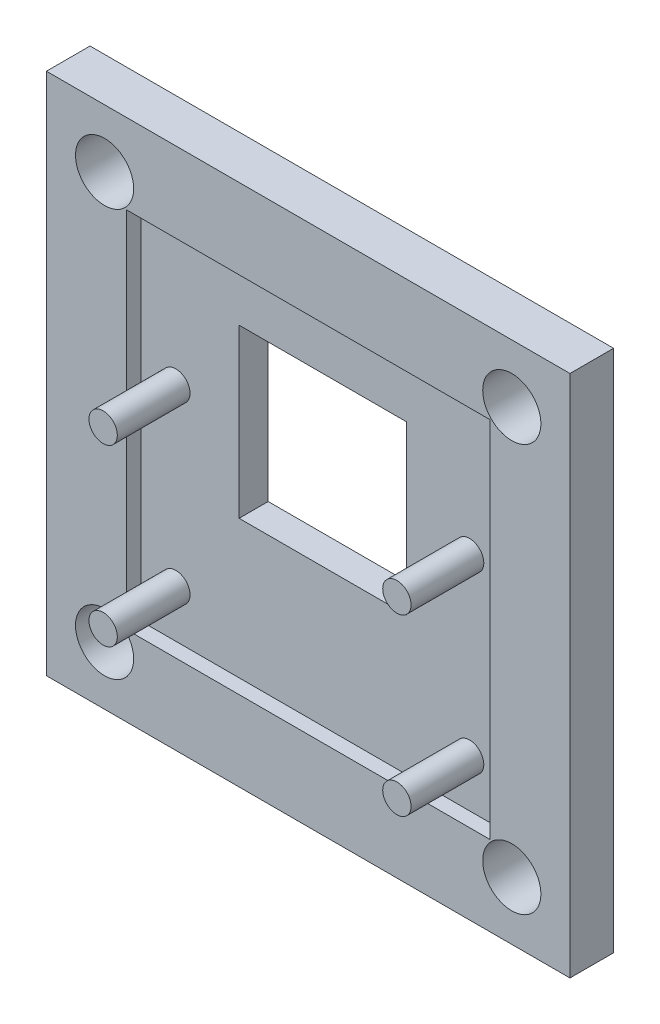
ISO-10303-21;
HEADER;
FILE_DESCRIPTION(('STEP AP214'),'2;1');
FILE_NAME('part.step','',(''),(''),'','','');
FILE_SCHEMA(('AUTOMOTIVE_DESIGN { 1 0 10303 214 1 1 1 1 }'));
ENDSEC;
DATA;
#1=APPLICATION_CONTEXT('core data for automotive mechanical design processes');
#2=APPLICATION_PROTOCOL_DEFINITION('international standard','automotive_design',2000,#1);
#3=PRODUCT_CONTEXT('',#1,'mechanical');
#4=PRODUCT('Part','Part','',(#3));
#5=PRODUCT_RELATED_PRODUCT_CATEGORY('part','',(#4));
#6=PRODUCT_DEFINITION_FORMATION('','',#4);
#7=PRODUCT_DEFINITION_CONTEXT('part definition',#1,'design');
#8=PRODUCT_DEFINITION('design','',#6,#7);
#9=PRODUCT_DEFINITION_SHAPE('','',#8);
#10=(LENGTH_UNIT() NAMED_UNIT(*) SI_UNIT(.MILLI.,.METRE.));
#11=(NAMED_UNIT(*) PLANE_ANGLE_UNIT() SI_UNIT($,.RADIAN.));
#12=(NAMED_UNIT(*) SI_UNIT($,.STERADIAN.) SOLID_ANGLE_UNIT());
#13=UNCERTAINTY_MEASURE_WITH_UNIT(LENGTH_MEASURE(1.E-05),#10,'distance_accuracy_value','');
#14=(GEOMETRIC_REPRESENTATION_CONTEXT(3) GLOBAL_UNCERTAINTY_ASSIGNED_CONTEXT((#13)) GLOBAL_UNIT_ASSIGNED_CONTEXT((#10,
#11,#12)) REPRESENTATION_CONTEXT('',''));
#15=CARTESIAN_POINT('',(0.,0.,0.));
#16=DIRECTION('',(0.,0.,1.));
#17=DIRECTION('',(1.,0.,0.));
#18=AXIS2_PLACEMENT_3D('',#15,#16,#17);
#19=CARTESIAN_POINT('',(0.,0.,2.));
#20=DIRECTION('',(0.,0.,-1.));
#21=DIRECTION('',(-1.,0.,0.));
#22=AXIS2_PLACEMENT_3D('',#19,#20,#21);
#23=PLANE('',#22);
#24=CARTESIAN_POINT('',(-10.1,2.75,2.));
#25=DIRECTION('',(0.,0.,-1.));
#26=DIRECTION('',(-1.,0.,0.));
#27=AXIS2_PLACEMENT_3D('',#24,#25,#26);
#28=CIRCLE('',#27,0.975);
#29=CARTESIAN_POINT('',(-11.075,2.75,2.));
#30=VERTEX_POINT('',#29);
#31=EDGE_CURVE('E11',#30,#30,#28,.F.);
#32=ORIENTED_EDGE('',*,*,#31,.F.);
#33=EDGE_LOOP('',(#32));
#34=FACE_BOUND('',#33,.T.);
#35=CARTESIAN_POINT('',(-10.1,-9.25,2.));
#36=DIRECTION('',(0.,0.,-1.));
#37=DIRECTION('',(-1.,0.,0.));
#38=AXIS2_PLACEMENT_3D('',#35,#36,#37);
#39=CIRCLE('',#38,0.975);
#40=CARTESIAN_POINT('',(-11.075,-9.25,2.));
#41=VERTEX_POINT('',#40);
#42=EDGE_CURVE('E54',#41,#41,#39,.F.);
#43=ORIENTED_EDGE('',*,*,#42,.F.);
#44=EDGE_LOOP('',(#43));
#45=FACE_BOUND('',#44,.T.);
#46=CARTESIAN_POINT('',(10.1,-9.25,2.));
#47=DIRECTION('',(0.,0.,-1.));
#48=DIRECTION('',(-1.,0.,0.));
#49=AXIS2_PLACEMENT_3D('',#46,#47,#48);
#50=CIRCLE('',#49,0.975);
#51=CARTESIAN_POINT('',(9.125,-9.25,2.));
#52=VERTEX_POINT('',#51);
#53=EDGE_CURVE('E309',#52,#52,#50,.F.);
#54=ORIENTED_EDGE('',*,*,#53,.F.);
#55=EDGE_LOOP('',(#54));
#56=FACE_BOUND('',#55,.T.);
#57=CARTESIAN_POINT('',(10.1,2.75,2.));
#58=DIRECTION('',(0.,0.,-1.));
#59=DIRECTION('',(-1.,0.,0.));
#60=AXIS2_PLACEMENT_3D('',#57,#58,#59);
#61=CIRCLE('',#60,0.975);
#62=CARTESIAN_POINT('',(9.125,2.75,2.));
#63=VERTEX_POINT('',#62);
#64=EDGE_CURVE('E291',#63,#63,#61,.F.);
#65=ORIENTED_EDGE('',*,*,#64,.F.);
#66=EDGE_LOOP('',(#65));
#67=FACE_BOUND('',#66,.T.);
#68=DIRECTION('',(0.,1.,0.));
#69=VECTOR('',#68,1.);
#70=CARTESIAN_POINT('',(12.5,-12.5,2.));
#71=LINE('',#70,#69);
#72=CARTESIAN_POINT('',(12.5,-12.5,2.));
#73=VERTEX_POINT('',#72);
#74=CARTESIAN_POINT('',(12.5,12.5,2.));
#75=VERTEX_POINT('',#74);
#76=EDGE_CURVE('E188',#73,#75,#71,.T.);
#77=ORIENTED_EDGE('',*,*,#76,.T.);
#78=DIRECTION('',(-1.,0.,0.));
#79=VECTOR('',#78,1.);
#80=CARTESIAN_POINT('',(-12.5,12.5,2.));
#81=LINE('',#80,#79);
#82=CARTESIAN_POINT('',(-12.5,12.5,2.));
#83=VERTEX_POINT('',#82);
#84=EDGE_CURVE('E192',#75,#83,#81,.T.);
#85=ORIENTED_EDGE('',*,*,#84,.T.);
#86=DIRECTION('',(0.,-1.,0.));
#87=VECTOR('',#86,1.);
#88=CARTESIAN_POINT('',(-12.5,-12.5,2.));
#89=LINE('',#88,#87);
#90=CARTESIAN_POINT('',(-12.5,-12.5,2.));
#91=VERTEX_POINT('',#90);
#92=EDGE_CURVE('E197',#83,#91,#89,.T.);
#93=ORIENTED_EDGE('',*,*,#92,.T.);
#94=DIRECTION('',(1.,0.,0.));
#95=VECTOR('',#94,1.);
#96=CARTESIAN_POINT('',(-12.5,-12.5,2.));
#97=LINE('',#96,#95);
#98=EDGE_CURVE('E201',#91,#73,#97,.T.);
#99=ORIENTED_EDGE('',*,*,#98,.T.);
#100=EDGE_LOOP('',(#77,#85,#93,#99));
#101=FACE_BOUND('',#100,.T.);
#102=DIRECTION('',(0.,1.,0.));
#103=VECTOR('',#102,1.);
#104=CARTESIAN_POINT('',(5.75,-3.,2.));
#105=LINE('',#104,#103);
#106=CARTESIAN_POINT('',(5.75,-3.,2.));
#107=VERTEX_POINT('',#106);
#108=CARTESIAN_POINT('',(5.75,8.5,2.));
#109=VERTEX_POINT('',#108);
#110=EDGE_CURVE('E141',#107,#109,#105,.T.);
#111=ORIENTED_EDGE('',*,*,#110,.F.);
#112=DIRECTION('',(1.,0.,0.));
#113=VECTOR('',#112,1.);
#114=CARTESIAN_POINT('',(-5.75,-3.,2.));
#115=LINE('',#114,#113);
#116=CARTESIAN_POINT('',(-5.75,-3.,2.));
#117=VERTEX_POINT('',#116);
#118=EDGE_CURVE('E159',#117,#107,#115,.T.);
#119=ORIENTED_EDGE('',*,*,#118,.F.);
#120=DIRECTION('',(0.,-1.,0.));
#121=VECTOR('',#120,1.);
#122=CARTESIAN_POINT('',(-5.75,-3.,2.));
#123=LINE('',#122,#121);
#124=CARTESIAN_POINT('',(-5.75,8.5,2.));
#125=VERTEX_POINT('',#124);
#126=EDGE_CURVE('E61',#125,#117,#123,.T.);
#127=ORIENTED_EDGE('',*,*,#126,.F.);
#128=DIRECTION('',(-1.,0.,0.));
#129=VECTOR('',#128,1.);
#130=CARTESIAN_POINT('',(-5.75,8.5,2.));
#131=LINE('',#130,#129);
#132=EDGE_CURVE('E174',#109,#125,#131,.T.);
#133=ORIENTED_EDGE('',*,*,#132,.F.);
#134=EDGE_LOOP('',(#111,#119,#127,#133));
#135=FACE_BOUND('',#134,.T.);
#136=ADVANCED_FACE('F45',(#34,#45,#56,#67,#101,#135),#23,.F.);
#137=CARTESIAN_POINT('',(18.,-18.,3.));
#138=DIRECTION('',(-1.,0.,0.));
#139=DIRECTION('',(0.,0.,1.));
#140=AXIS2_PLACEMENT_3D('',#137,#138,#139);
#141=PLANE('',#140);
#142=DIRECTION('',(0.,1.,0.));
#143=VECTOR('',#142,1.);
#144=CARTESIAN_POINT('',(18.,-18.,0.));
#145=LINE('',#144,#143);
#146=CARTESIAN_POINT('',(18.,-18.,0.));
#147=VERTEX_POINT('',#146);
#148=CARTESIAN_POINT('',(18.,18.,0.));
#149=VERTEX_POINT('',#148);
#150=EDGE_CURVE('E263',#147,#149,#145,.T.);
#151=ORIENTED_EDGE('',*,*,#150,.T.);
#152=DIRECTION('',(0.,0.,-1.));
#153=VECTOR('',#152,1.);
#154=CARTESIAN_POINT('',(18.,18.,3.));
#155=LINE('',#154,#153);
#156=CARTESIAN_POINT('',(18.,18.,3.));
#157=VERTEX_POINT('',#156);
#158=EDGE_CURVE('E287',#157,#149,#155,.T.);
#159=ORIENTED_EDGE('',*,*,#158,.F.);
#160=DIRECTION('',(0.,1.,0.));
#161=VECTOR('',#160,1.);
#162=CARTESIAN_POINT('',(18.,-18.,3.));
#163=LINE('',#162,#161);
#164=CARTESIAN_POINT('',(18.,-18.,3.));
#165=VERTEX_POINT('',#164);
#166=EDGE_CURVE('E248',#165,#157,#163,.T.);
#167=ORIENTED_EDGE('',*,*,#166,.F.);
#168=DIRECTION('',(0.,0.,-1.));
#169=VECTOR('',#168,1.);
#170=CARTESIAN_POINT('',(18.,-18.,3.));
#171=LINE('',#170,#169);
#172=EDGE_CURVE('E262',#165,#147,#171,.T.);
#173=ORIENTED_EDGE('',*,*,#172,.T.);
#174=EDGE_LOOP('',(#151,#159,#167,#173));
#175=FACE_BOUND('',#174,.T.);
#176=ADVANCED_FACE('F47',(#175),#141,.F.);
#177=CARTESIAN_POINT('',(-18.,18.,3.));
#178=DIRECTION('',(0.,-1.,0.));
#179=DIRECTION('',(0.,0.,-1.));
#180=AXIS2_PLACEMENT_3D('',#177,#178,#179);
#181=PLANE('',#180);
#182=DIRECTION('',(-1.,0.,0.));
#183=VECTOR('',#182,1.);
#184=CARTESIAN_POINT('',(-18.,18.,0.));
#185=LINE('',#184,#183);
#186=CARTESIAN_POINT('',(-18.,18.,0.));
#187=VERTEX_POINT('',#186);
#188=EDGE_CURVE('E267',#149,#187,#185,.T.);
#189=ORIENTED_EDGE('',*,*,#188,.T.);
#190=DIRECTION('',(0.,0.,-1.));
#191=VECTOR('',#190,1.);
#192=CARTESIAN_POINT('',(-18.,18.,3.));
#193=LINE('',#192,#191);
#194=CARTESIAN_POINT('',(-18.,18.,3.));
#195=VERTEX_POINT('',#194);
#196=EDGE_CURVE('E283',#195,#187,#193,.T.);
#197=ORIENTED_EDGE('',*,*,#196,.F.);
#198=DIRECTION('',(-1.,0.,0.));
#199=VECTOR('',#198,1.);
#200=CARTESIAN_POINT('',(-18.,18.,3.));
#201=LINE('',#200,#199);
#202=EDGE_CURVE('E252',#157,#195,#201,.T.);
#203=ORIENTED_EDGE('',*,*,#202,.F.);
#204=ORIENTED_EDGE('',*,*,#158,.T.);
#205=EDGE_LOOP('',(#189,#197,#203,#204));
#206=FACE_BOUND('',#205,.T.);
#207=ADVANCED_FACE('F389',(#206),#181,.F.);
#208=CARTESIAN_POINT('',(-18.,-18.,3.));
#209=DIRECTION('',(1.,0.,0.));
#210=DIRECTION('',(0.,0.,-1.));
#211=AXIS2_PLACEMENT_3D('',#208,#209,#210);
#212=PLANE('',#211);
#213=DIRECTION('',(0.,-1.,0.));
#214=VECTOR('',#213,1.);
#215=CARTESIAN_POINT('',(-18.,-18.,0.));
#216=LINE('',#215,#214);
#217=CARTESIAN_POINT('',(-18.,-18.,0.));
#218=VERTEX_POINT('',#217);
#219=EDGE_CURVE('E271',#187,#218,#216,.T.);
#220=ORIENTED_EDGE('',*,*,#219,.T.);
#221=DIRECTION('',(0.,0.,-1.));
#222=VECTOR('',#221,1.);
#223=CARTESIAN_POINT('',(-18.,-18.,3.));
#224=LINE('',#223,#222);
#225=CARTESIAN_POINT('',(-18.,-18.,3.));
#226=VERTEX_POINT('',#225);
#227=EDGE_CURVE('E279',#226,#218,#224,.T.);
#228=ORIENTED_EDGE('',*,*,#227,.F.);
#229=DIRECTION('',(0.,-1.,0.));
#230=VECTOR('',#229,1.);
#231=CARTESIAN_POINT('',(-18.,-18.,3.));
#232=LINE('',#231,#230);
#233=EDGE_CURVE('E256',#195,#226,#232,.T.);
#234=ORIENTED_EDGE('',*,*,#233,.F.);
#235=ORIENTED_EDGE('',*,*,#196,.T.);
#236=EDGE_LOOP('',(#220,#228,#234,#235));
#237=FACE_BOUND('',#236,.T.);
#238=ADVANCED_FACE('F386',(#237),#212,.F.);
#239=CARTESIAN_POINT('',(-18.,-18.,3.));
#240=DIRECTION('',(0.,1.,0.));
#241=DIRECTION('',(0.,0.,1.));
#242=AXIS2_PLACEMENT_3D('',#239,#240,#241);
#243=PLANE('',#242);
#244=DIRECTION('',(1.,0.,0.));
#245=VECTOR('',#244,1.);
#246=CARTESIAN_POINT('',(-18.,-18.,0.));
#247=LINE('',#246,#245);
#248=EDGE_CURVE('E253',#218,#147,#247,.T.);
#249=ORIENTED_EDGE('',*,*,#248,.T.);
#250=ORIENTED_EDGE('',*,*,#172,.F.);
#251=DIRECTION('',(1.,0.,0.));
#252=VECTOR('',#251,1.);
#253=CARTESIAN_POINT('',(-18.,-18.,3.));
#254=LINE('',#253,#252);
#255=EDGE_CURVE('E259',#226,#165,#254,.T.);
#256=ORIENTED_EDGE('',*,*,#255,.F.);
#257=ORIENTED_EDGE('',*,*,#227,.T.);
#258=EDGE_LOOP('',(#249,#250,#256,#257));
#259=FACE_BOUND('',#258,.T.);
#260=ADVANCED_FACE('F380',(#259),#243,.F.);
#261=CARTESIAN_POINT('',(0.,0.,3.));
#262=DIRECTION('',(0.,0.,-1.));
#263=DIRECTION('',(-1.,0.,0.));
#264=AXIS2_PLACEMENT_3D('',#261,#262,#263);
#265=PLANE('',#264);
#266=DIRECTION('',(-1.,0.,0.));
#267=VECTOR('',#266,1.);
#268=CARTESIAN_POINT('',(-12.5,12.5,3.));
#269=LINE('',#268,#267);
#270=CARTESIAN_POINT('',(12.5,12.5,3.));
#271=VERTEX_POINT('',#270);
#272=CARTESIAN_POINT('',(-12.5,12.5,3.));
#273=VERTEX_POINT('',#272);
#274=EDGE_CURVE('E208',#271,#273,#269,.T.);
#275=ORIENTED_EDGE('',*,*,#274,.F.);
#276=DIRECTION('',(0.,1.,0.));
#277=VECTOR('',#276,1.);
#278=CARTESIAN_POINT('',(12.5,-12.5,3.));
#279=LINE('',#278,#277);
#280=CARTESIAN_POINT('',(12.5,-12.5,3.));
#281=VERTEX_POINT('',#280);
#282=EDGE_CURVE('E182',#281,#271,#279,.T.);
#283=ORIENTED_EDGE('',*,*,#282,.F.);
#284=DIRECTION('',(1.,0.,0.));
#285=VECTOR('',#284,1.);
#286=CARTESIAN_POINT('',(-12.5,-12.5,3.));
#287=LINE('',#286,#285);
#288=CARTESIAN_POINT('',(-12.5,-12.5,3.));
#289=VERTEX_POINT('',#288);
#290=EDGE_CURVE('E193',#289,#281,#287,.T.);
#291=ORIENTED_EDGE('',*,*,#290,.F.);
#292=DIRECTION('',(0.,-1.,0.));
#293=VECTOR('',#292,1.);
#294=CARTESIAN_POINT('',(-12.5,-12.5,3.));
#295=LINE('',#294,#293);
#296=EDGE_CURVE('E212',#273,#289,#295,.T.);
#297=ORIENTED_EDGE('',*,*,#296,.F.);
#298=EDGE_LOOP('',(#275,#283,#291,#297));
#299=FACE_BOUND('',#298,.T.);
#300=CARTESIAN_POINT('',(14.,14.,3.));
#301=DIRECTION('',(0.,0.,1.));
#302=DIRECTION('',(-1.,0.,0.));
#303=AXIS2_PLACEMENT_3D('',#300,#301,#302);
#304=CIRCLE('',#303,2.);
#305=CARTESIAN_POINT('',(12.,14.,3.));
#306=VERTEX_POINT('',#305);
#307=EDGE_CURVE('E222',#306,#306,#304,.T.);
#308=ORIENTED_EDGE('',*,*,#307,.F.);
#309=EDGE_LOOP('',(#308));
#310=FACE_BOUND('',#309,.T.);
#311=CARTESIAN_POINT('',(14.,-14.,3.));
#312=DIRECTION('',(0.,0.,1.));
#313=DIRECTION('',(1.,0.,0.));
#314=AXIS2_PLACEMENT_3D('',#311,#312,#313);
#315=CIRCLE('',#314,2.);
#316=CARTESIAN_POINT('',(16.,-14.,3.));
#317=VERTEX_POINT('',#316);
#318=EDGE_CURVE('E237',#317,#317,#315,.T.);
#319=ORIENTED_EDGE('',*,*,#318,.F.);
#320=EDGE_LOOP('',(#319));
#321=FACE_BOUND('',#320,.T.);
#322=CARTESIAN_POINT('',(-14.,-14.,3.));
#323=DIRECTION('',(0.,0.,1.));
#324=DIRECTION('',(-1.,0.,0.));
#325=AXIS2_PLACEMENT_3D('',#322,#323,#324);
#326=CIRCLE('',#325,2.);
#327=CARTESIAN_POINT('',(-16.,-14.,3.));
#328=VERTEX_POINT('',#327);
#329=EDGE_CURVE('E232',#328,#328,#326,.T.);
#330=ORIENTED_EDGE('',*,*,#329,.F.);
#331=EDGE_LOOP('',(#330));
#332=FACE_BOUND('',#331,.T.);
#333=CARTESIAN_POINT('',(-14.,14.,3.));
#334=DIRECTION('',(0.,0.,1.));
#335=DIRECTION('',(1.,0.,0.));
#336=AXIS2_PLACEMENT_3D('',#333,#334,#335);
#337=CIRCLE('',#336,2.);
#338=CARTESIAN_POINT('',(-12.,14.,3.));
#339=VERTEX_POINT('',#338);
#340=EDGE_CURVE('E236',#339,#339,#337,.T.);
#341=ORIENTED_EDGE('',*,*,#340,.F.);
#342=EDGE_LOOP('',(#341));
#343=FACE_BOUND('',#342,.T.);
#344=ORIENTED_EDGE('',*,*,#166,.T.);
#345=ORIENTED_EDGE('',*,*,#202,.T.);
#346=ORIENTED_EDGE('',*,*,#233,.T.);
#347=ORIENTED_EDGE('',*,*,#255,.T.);
#348=EDGE_LOOP('',(#344,#345,#346,#347));
#349=FACE_BOUND('',#348,.T.);
#350=ADVANCED_FACE('F377',(#299,#310,#321,#332,#343,#349),#265,.F.);
#351=CARTESIAN_POINT('',(0.,0.,0.));
#352=DIRECTION('',(0.,0.,-1.));
#353=DIRECTION('',(-1.,0.,0.));
#354=AXIS2_PLACEMENT_3D('',#351,#352,#353);
#355=PLANE('',#354);
#356=DIRECTION('',(0.,1.,0.));
#357=VECTOR('',#356,1.);
#358=CARTESIAN_POINT('',(5.75,-3.,0.));
#359=LINE('',#358,#357);
#360=CARTESIAN_POINT('',(5.75,-3.,0.));
#361=VERTEX_POINT('',#360);
#362=CARTESIAN_POINT('',(5.75,8.5,0.));
#363=VERTEX_POINT('',#362);
#364=EDGE_CURVE('E138',#361,#363,#359,.T.);
#365=ORIENTED_EDGE('',*,*,#364,.T.);
#366=DIRECTION('',(-1.,0.,0.));
#367=VECTOR('',#366,1.);
#368=CARTESIAN_POINT('',(-5.75,8.5,0.));
#369=LINE('',#368,#367);
#370=CARTESIAN_POINT('',(-5.75,8.5,0.));
#371=VERTEX_POINT('',#370);
#372=EDGE_CURVE('E150',#363,#371,#369,.T.);
#373=ORIENTED_EDGE('',*,*,#372,.T.);
#374=DIRECTION('',(0.,-1.,0.));
#375=VECTOR('',#374,1.);
#376=CARTESIAN_POINT('',(-5.75,-3.,0.));
#377=LINE('',#376,#375);
#378=CARTESIAN_POINT('',(-5.75,-3.,0.));
#379=VERTEX_POINT('',#378);
#380=EDGE_CURVE('E66',#371,#379,#377,.T.);
#381=ORIENTED_EDGE('',*,*,#380,.T.);
#382=DIRECTION('',(1.,0.,0.));
#383=VECTOR('',#382,1.);
#384=CARTESIAN_POINT('',(-5.75,-3.,0.));
#385=LINE('',#384,#383);
#386=EDGE_CURVE('E147',#379,#361,#385,.T.);
#387=ORIENTED_EDGE('',*,*,#386,.T.);
#388=EDGE_LOOP('',(#365,#373,#381,#387));
#389=FACE_BOUND('',#388,.T.);
#390=CARTESIAN_POINT('',(14.,14.,0.));
#391=DIRECTION('',(0.,0.,-1.));
#392=DIRECTION('',(-1.,0.,0.));
#393=AXIS2_PLACEMENT_3D('',#390,#391,#392);
#394=CIRCLE('',#393,2.);
#395=CARTESIAN_POINT('',(12.,14.,0.));
#396=VERTEX_POINT('',#395);
#397=EDGE_CURVE('E268',#396,#396,#394,.T.);
#398=ORIENTED_EDGE('',*,*,#397,.F.);
#399=EDGE_LOOP('',(#398));
#400=FACE_BOUND('',#399,.T.);
#401=CARTESIAN_POINT('',(14.,-14.,0.));
#402=DIRECTION('',(0.,0.,-1.));
#403=DIRECTION('',(-1.,0.,0.));
#404=AXIS2_PLACEMENT_3D('',#401,#402,#403);
#405=CIRCLE('',#404,2.);
#406=CARTESIAN_POINT('',(12.,-14.,0.));
#407=VERTEX_POINT('',#406);
#408=EDGE_CURVE('E299',#407,#407,#405,.T.);
#409=ORIENTED_EDGE('',*,*,#408,.F.);
#410=EDGE_LOOP('',(#409));
#411=FACE_BOUND('',#410,.T.);
#412=CARTESIAN_POINT('',(-14.,-14.,0.));
#413=DIRECTION('',(0.,0.,-1.));
#414=DIRECTION('',(-1.,0.,0.));
#415=AXIS2_PLACEMENT_3D('',#412,#413,#414);
#416=CIRCLE('',#415,2.);
#417=CARTESIAN_POINT('',(-16.,-14.,0.));
#418=VERTEX_POINT('',#417);
#419=EDGE_CURVE('E295',#418,#418,#416,.T.);
#420=ORIENTED_EDGE('',*,*,#419,.F.);
#421=EDGE_LOOP('',(#420));
#422=FACE_BOUND('',#421,.T.);
#423=CARTESIAN_POINT('',(-14.,14.,0.));
#424=DIRECTION('',(0.,0.,-1.));
#425=DIRECTION('',(-1.,0.,0.));
#426=AXIS2_PLACEMENT_3D('',#423,#424,#425);
#427=CIRCLE('',#426,2.);
#428=CARTESIAN_POINT('',(-16.,14.,0.));
#429=VERTEX_POINT('',#428);
#430=EDGE_CURVE('E247',#429,#429,#427,.T.);
#431=ORIENTED_EDGE('',*,*,#430,.F.);
#432=EDGE_LOOP('',(#431));
#433=FACE_BOUND('',#432,.T.);
#434=ORIENTED_EDGE('',*,*,#150,.F.);
#435=ORIENTED_EDGE('',*,*,#248,.F.);
#436=ORIENTED_EDGE('',*,*,#219,.F.);
#437=ORIENTED_EDGE('',*,*,#188,.F.);
#438=EDGE_LOOP('',(#434,#435,#436,#437));
#439=FACE_BOUND('',#438,.T.);
#440=ADVANCED_FACE('F155',(#389,#400,#411,#422,#433,#439),#355,.T.);
#441=CARTESIAN_POINT('',(-14.,14.,-7.));
#442=DIRECTION('',(0.,0.,1.));
#443=DIRECTION('',(1.,0.,0.));
#444=AXIS2_PLACEMENT_3D('',#441,#442,#443);
#445=CYLINDRICAL_SURFACE('',#444,2.);
#446=ORIENTED_EDGE('',*,*,#430,.T.);
#447=EDGE_LOOP('',(#446));
#448=FACE_BOUND('',#447,.T.);
#449=ORIENTED_EDGE('',*,*,#340,.T.);
#450=EDGE_LOOP('',(#449));
#451=FACE_BOUND('',#450,.T.);
#452=ADVANCED_FACE('F366',(#448,#451),#445,.F.);
#453=CARTESIAN_POINT('',(-14.,-14.,-7.));
#454=DIRECTION('',(0.,0.,1.));
#455=DIRECTION('',(1.,0.,0.));
#456=AXIS2_PLACEMENT_3D('',#453,#454,#455);
#457=CYLINDRICAL_SURFACE('',#456,2.);
#458=ORIENTED_EDGE('',*,*,#419,.T.);
#459=EDGE_LOOP('',(#458));
#460=FACE_BOUND('',#459,.T.);
#461=ORIENTED_EDGE('',*,*,#329,.T.);
#462=EDGE_LOOP('',(#461));
#463=FACE_BOUND('',#462,.T.);
#464=ADVANCED_FACE('F362',(#460,#463),#457,.F.);
#465=CARTESIAN_POINT('',(14.,-14.,-7.));
#466=DIRECTION('',(0.,0.,1.));
#467=DIRECTION('',(1.,0.,0.));
#468=AXIS2_PLACEMENT_3D('',#465,#466,#467);
#469=CYLINDRICAL_SURFACE('',#468,2.);
#470=ORIENTED_EDGE('',*,*,#408,.T.);
#471=EDGE_LOOP('',(#470));
#472=FACE_BOUND('',#471,.T.);
#473=ORIENTED_EDGE('',*,*,#318,.T.);
#474=EDGE_LOOP('',(#473));
#475=FACE_BOUND('',#474,.T.);
#476=ADVANCED_FACE('F365',(#472,#475),#469,.F.);
#477=CARTESIAN_POINT('',(14.,14.,-7.));
#478=DIRECTION('',(0.,0.,1.));
#479=DIRECTION('',(1.,0.,0.));
#480=AXIS2_PLACEMENT_3D('',#477,#478,#479);
#481=CYLINDRICAL_SURFACE('',#480,2.);
#482=ORIENTED_EDGE('',*,*,#397,.T.);
#483=EDGE_LOOP('',(#482));
#484=FACE_BOUND('',#483,.T.);
#485=ORIENTED_EDGE('',*,*,#307,.T.);
#486=EDGE_LOOP('',(#485));
#487=FACE_BOUND('',#486,.T.);
#488=ADVANCED_FACE('F360',(#484,#487),#481,.F.);
#489=CARTESIAN_POINT('',(12.5,-12.5,2.));
#490=DIRECTION('',(1.,0.,0.));
#491=DIRECTION('',(0.,0.,-1.));
#492=AXIS2_PLACEMENT_3D('',#489,#490,#491);
#493=PLANE('',#492);
#494=ORIENTED_EDGE('',*,*,#282,.T.);
#495=DIRECTION('',(0.,0.,1.));
#496=VECTOR('',#495,1.);
#497=CARTESIAN_POINT('',(12.5,12.5,2.));
#498=LINE('',#497,#496);
#499=EDGE_CURVE('E205',#75,#271,#498,.T.);
#500=ORIENTED_EDGE('',*,*,#499,.F.);
#501=ORIENTED_EDGE('',*,*,#76,.F.);
#502=DIRECTION('',(0.,0.,1.));
#503=VECTOR('',#502,1.);
#504=CARTESIAN_POINT('',(12.5,-12.5,2.));
#505=LINE('',#504,#503);
#506=EDGE_CURVE('E219',#73,#281,#505,.T.);
#507=ORIENTED_EDGE('',*,*,#506,.T.);
#508=EDGE_LOOP('',(#494,#500,#501,#507));
#509=FACE_BOUND('',#508,.T.);
#510=ADVANCED_FACE('F350',(#509),#493,.F.);
#511=CARTESIAN_POINT('',(-12.5,-12.5,2.));
#512=DIRECTION('',(0.,-1.,0.));
#513=DIRECTION('',(0.,0.,-1.));
#514=AXIS2_PLACEMENT_3D('',#511,#512,#513);
#515=PLANE('',#514);
#516=ORIENTED_EDGE('',*,*,#290,.T.);
#517=ORIENTED_EDGE('',*,*,#506,.F.);
#518=ORIENTED_EDGE('',*,*,#98,.F.);
#519=DIRECTION('',(0.,0.,1.));
#520=VECTOR('',#519,1.);
#521=CARTESIAN_POINT('',(-12.5,-12.5,2.));
#522=LINE('',#521,#520);
#523=EDGE_CURVE('E223',#91,#289,#522,.T.);
#524=ORIENTED_EDGE('',*,*,#523,.T.);
#525=EDGE_LOOP('',(#516,#517,#518,#524));
#526=FACE_BOUND('',#525,.T.);
#527=ADVANCED_FACE('F346',(#526),#515,.F.);
#528=CARTESIAN_POINT('',(-12.5,-12.5,2.));
#529=DIRECTION('',(-1.,0.,0.));
#530=DIRECTION('',(0.,0.,1.));
#531=AXIS2_PLACEMENT_3D('',#528,#529,#530);
#532=PLANE('',#531);
#533=ORIENTED_EDGE('',*,*,#296,.T.);
#534=ORIENTED_EDGE('',*,*,#523,.F.);
#535=ORIENTED_EDGE('',*,*,#92,.F.);
#536=DIRECTION('',(0.,0.,1.));
#537=VECTOR('',#536,1.);
#538=CARTESIAN_POINT('',(-12.5,12.5,2.));
#539=LINE('',#538,#537);
#540=EDGE_CURVE('E226',#83,#273,#539,.T.);
#541=ORIENTED_EDGE('',*,*,#540,.T.);
#542=EDGE_LOOP('',(#533,#534,#535,#541));
#543=FACE_BOUND('',#542,.T.);
#544=ADVANCED_FACE('F349',(#543),#532,.F.);
#545=CARTESIAN_POINT('',(-12.5,12.5,2.));
#546=DIRECTION('',(0.,1.,0.));
#547=DIRECTION('',(0.,0.,1.));
#548=AXIS2_PLACEMENT_3D('',#545,#546,#547);
#549=PLANE('',#548);
#550=ORIENTED_EDGE('',*,*,#274,.T.);
#551=ORIENTED_EDGE('',*,*,#540,.F.);
#552=ORIENTED_EDGE('',*,*,#84,.F.);
#553=ORIENTED_EDGE('',*,*,#499,.T.);
#554=EDGE_LOOP('',(#550,#551,#552,#553));
#555=FACE_BOUND('',#554,.T.);
#556=ADVANCED_FACE('F344',(#555),#549,.F.);
#557=CARTESIAN_POINT('',(5.75,-3.,0.));
#558=DIRECTION('',(1.,0.,0.));
#559=DIRECTION('',(0.,0.,-1.));
#560=AXIS2_PLACEMENT_3D('',#557,#558,#559);
#561=PLANE('',#560);
#562=ORIENTED_EDGE('',*,*,#110,.T.);
#563=DIRECTION('',(0.,0.,1.));
#564=VECTOR('',#563,1.);
#565=CARTESIAN_POINT('',(5.75,8.5,0.));
#566=LINE('',#565,#564);
#567=EDGE_CURVE('E134',#363,#109,#566,.T.);
#568=ORIENTED_EDGE('',*,*,#567,.F.);
#569=ORIENTED_EDGE('',*,*,#364,.F.);
#570=DIRECTION('',(0.,0.,1.));
#571=VECTOR('',#570,1.);
#572=CARTESIAN_POINT('',(5.75,-3.,0.));
#573=LINE('',#572,#571);
#574=EDGE_CURVE('E179',#361,#107,#573,.T.);
#575=ORIENTED_EDGE('',*,*,#574,.T.);
#576=EDGE_LOOP('',(#562,#568,#569,#575));
#577=FACE_BOUND('',#576,.T.);
#578=ADVANCED_FACE('F136',(#577),#561,.F.);
#579=CARTESIAN_POINT('',(-5.75,-3.,0.));
#580=DIRECTION('',(0.,-1.,0.));
#581=DIRECTION('',(0.,0.,-1.));
#582=AXIS2_PLACEMENT_3D('',#579,#580,#581);
#583=PLANE('',#582);
#584=ORIENTED_EDGE('',*,*,#118,.T.);
#585=ORIENTED_EDGE('',*,*,#574,.F.);
#586=ORIENTED_EDGE('',*,*,#386,.F.);
#587=DIRECTION('',(0.,0.,1.));
#588=VECTOR('',#587,1.);
#589=CARTESIAN_POINT('',(-5.75,-3.,0.));
#590=LINE('',#589,#588);
#591=EDGE_CURVE('E183',#379,#117,#590,.T.);
#592=ORIENTED_EDGE('',*,*,#591,.T.);
#593=EDGE_LOOP('',(#584,#585,#586,#592));
#594=FACE_BOUND('',#593,.T.);
#595=ADVANCED_FACE('F330',(#594),#583,.F.);
#596=CARTESIAN_POINT('',(-5.75,-3.,0.));
#597=DIRECTION('',(-1.,0.,0.));
#598=DIRECTION('',(0.,0.,1.));
#599=AXIS2_PLACEMENT_3D('',#596,#597,#598);
#600=PLANE('',#599);
#601=ORIENTED_EDGE('',*,*,#126,.T.);
#602=ORIENTED_EDGE('',*,*,#591,.F.);
#603=ORIENTED_EDGE('',*,*,#380,.F.);
#604=DIRECTION('',(0.,0.,1.));
#605=VECTOR('',#604,1.);
#606=CARTESIAN_POINT('',(-5.75,8.5,0.));
#607=LINE('',#606,#605);
#608=EDGE_CURVE('E146',#371,#125,#607,.T.);
#609=ORIENTED_EDGE('',*,*,#608,.T.);
#610=EDGE_LOOP('',(#601,#602,#603,#609));
#611=FACE_BOUND('',#610,.T.);
#612=ADVANCED_FACE('F331',(#611),#600,.F.);
#613=CARTESIAN_POINT('',(-5.75,8.5,0.));
#614=DIRECTION('',(0.,1.,0.));
#615=DIRECTION('',(0.,0.,1.));
#616=AXIS2_PLACEMENT_3D('',#613,#614,#615);
#617=PLANE('',#616);
#618=ORIENTED_EDGE('',*,*,#132,.T.);
#619=ORIENTED_EDGE('',*,*,#608,.F.);
#620=ORIENTED_EDGE('',*,*,#372,.F.);
#621=ORIENTED_EDGE('',*,*,#567,.T.);
#622=EDGE_LOOP('',(#618,#619,#620,#621));
#623=FACE_BOUND('',#622,.T.);
#624=ADVANCED_FACE('F151',(#623),#617,.F.);
#625=CARTESIAN_POINT('',(10.1,2.75,7.));
#626=DIRECTION('',(0.,0.,-1.));
#627=DIRECTION('',(-1.,0.,0.));
#628=AXIS2_PLACEMENT_3D('',#625,#626,#627);
#629=CYLINDRICAL_SURFACE('',#628,0.975);
#630=CARTESIAN_POINT('',(10.1,2.75,7.));
#631=DIRECTION('',(0.,0.,1.));
#632=DIRECTION('',(1.,0.,0.));
#633=AXIS2_PLACEMENT_3D('',#630,#631,#632);
#634=CIRCLE('',#633,0.975);
#635=CARTESIAN_POINT('',(11.075,2.75,7.));
#636=VERTEX_POINT('',#635);
#637=EDGE_CURVE('E165',#636,#636,#634,.T.);
#638=ORIENTED_EDGE('',*,*,#637,.F.);
#639=EDGE_LOOP('',(#638));
#640=FACE_BOUND('',#639,.T.);
#641=ORIENTED_EDGE('',*,*,#64,.T.);
#642=EDGE_LOOP('',(#641));
#643=FACE_BOUND('',#642,.T.);
#644=ADVANCED_FACE('F338',(#640,#643),#629,.T.);
#645=CARTESIAN_POINT('',(10.1,2.75,7.));
#646=DIRECTION('',(0.,0.,1.));
#647=DIRECTION('',(1.,0.,0.));
#648=AXIS2_PLACEMENT_3D('',#645,#646,#647);
#649=PLANE('',#648);
#650=ORIENTED_EDGE('',*,*,#637,.T.);
#651=EDGE_LOOP('',(#650));
#652=FACE_BOUND('',#651,.T.);
#653=ADVANCED_FACE('F524',(#652),#649,.T.);
#654=CARTESIAN_POINT('',(10.1,-9.25,7.));
#655=DIRECTION('',(0.,0.,-1.));
#656=DIRECTION('',(-1.,0.,0.));
#657=AXIS2_PLACEMENT_3D('',#654,#655,#656);
#658=CYLINDRICAL_SURFACE('',#657,0.975);
#659=CARTESIAN_POINT('',(10.1,-9.25,7.));
#660=DIRECTION('',(0.,0.,1.));
#661=DIRECTION('',(1.,0.,0.));
#662=AXIS2_PLACEMENT_3D('',#659,#660,#661);
#663=CIRCLE('',#662,0.975);
#664=CARTESIAN_POINT('',(11.075,-9.25,7.));
#665=VERTEX_POINT('',#664);
#666=EDGE_CURVE('E603',#665,#665,#663,.T.);
#667=ORIENTED_EDGE('',*,*,#666,.F.);
#668=EDGE_LOOP('',(#667));
#669=FACE_BOUND('',#668,.T.);
#670=ORIENTED_EDGE('',*,*,#53,.T.);
#671=EDGE_LOOP('',(#670));
#672=FACE_BOUND('',#671,.T.);
#673=ADVANCED_FACE('F533',(#669,#672),#658,.T.);
#674=CARTESIAN_POINT('',(10.1,-9.25,7.));
#675=DIRECTION('',(0.,0.,1.));
#676=DIRECTION('',(1.,0.,0.));
#677=AXIS2_PLACEMENT_3D('',#674,#675,#676);
#678=PLANE('',#677);
#679=ORIENTED_EDGE('',*,*,#666,.T.);
#680=EDGE_LOOP('',(#679));
#681=FACE_BOUND('',#680,.T.);
#682=ADVANCED_FACE('F543',(#681),#678,.T.);
#683=CARTESIAN_POINT('',(-10.1,-9.25,7.));
#684=DIRECTION('',(0.,0.,-1.));
#685=DIRECTION('',(-1.,0.,0.));
#686=AXIS2_PLACEMENT_3D('',#683,#684,#685);
#687=CYLINDRICAL_SURFACE('',#686,0.975);
#688=CARTESIAN_POINT('',(-10.1,-9.25,7.));
#689=DIRECTION('',(0.,0.,1.));
#690=DIRECTION('',(-1.,0.,0.));
#691=AXIS2_PLACEMENT_3D('',#688,#689,#690);
#692=CIRCLE('',#691,0.975);
#693=CARTESIAN_POINT('',(-11.075,-9.25,7.));
#694=VERTEX_POINT('',#693);
#695=EDGE_CURVE('E599',#694,#694,#692,.T.);
#696=ORIENTED_EDGE('',*,*,#695,.F.);
#697=EDGE_LOOP('',(#696));
#698=FACE_BOUND('',#697,.T.);
#699=ORIENTED_EDGE('',*,*,#42,.T.);
#700=EDGE_LOOP('',(#699));
#701=FACE_BOUND('',#700,.T.);
#702=ADVANCED_FACE('F316',(#698,#701),#687,.T.);
#703=CARTESIAN_POINT('',(-10.1,-9.25,7.));
#704=DIRECTION('',(0.,0.,-1.));
#705=DIRECTION('',(-1.,0.,0.));
#706=AXIS2_PLACEMENT_3D('',#703,#704,#705);
#707=PLANE('',#706);
#708=ORIENTED_EDGE('',*,*,#695,.T.);
#709=EDGE_LOOP('',(#708));
#710=FACE_BOUND('',#709,.T.);
#711=ADVANCED_FACE('F562',(#710),#707,.F.);
#712=CARTESIAN_POINT('',(-10.1,2.75,7.));
#713=DIRECTION('',(0.,0.,-1.));
#714=DIRECTION('',(-1.,0.,0.));
#715=AXIS2_PLACEMENT_3D('',#712,#713,#714);
#716=CYLINDRICAL_SURFACE('',#715,0.975);
#717=CARTESIAN_POINT('',(-10.1,2.75,7.));
#718=DIRECTION('',(0.,0.,1.));
#719=DIRECTION('',(-1.,0.,0.));
#720=AXIS2_PLACEMENT_3D('',#717,#718,#719);
#721=CIRCLE('',#720,0.975);
#722=CARTESIAN_POINT('',(-11.075,2.75,7.));
#723=VERTEX_POINT('',#722);
#724=EDGE_CURVE('E597',#723,#723,#721,.T.);
#725=ORIENTED_EDGE('',*,*,#724,.F.);
#726=EDGE_LOOP('',(#725));
#727=FACE_BOUND('',#726,.T.);
#728=ORIENTED_EDGE('',*,*,#31,.T.);
#729=EDGE_LOOP('',(#728));
#730=FACE_BOUND('',#729,.T.);
#731=ADVANCED_FACE('F572',(#727,#730),#716,.T.);
#732=CARTESIAN_POINT('',(-10.1,2.75,7.));
#733=DIRECTION('',(0.,0.,-1.));
#734=DIRECTION('',(-1.,0.,0.));
#735=AXIS2_PLACEMENT_3D('',#732,#733,#734);
#736=PLANE('',#735);
#737=ORIENTED_EDGE('',*,*,#724,.T.);
#738=EDGE_LOOP('',(#737));
#739=FACE_BOUND('',#738,.T.);
#740=ADVANCED_FACE('F582',(#739),#736,.F.);
#741=CLOSED_SHELL('',(#136,#176,#207,#238,#260,#350,#440,#452,#464,#476,#488,#510,#527,#544,
#556,#578,#595,#612,#624,#644,#653,#673,#682,#702,#711,#731,#740));
#742=MANIFOLD_SOLID_BREP('B2',#741);
#743=ADVANCED_BREP_SHAPE_REPRESENTATION('',(#18,#742),#14);
#744=SHAPE_DEFINITION_REPRESENTATION(#9,#743);
ENDSEC;
END-ISO-10303-21;
